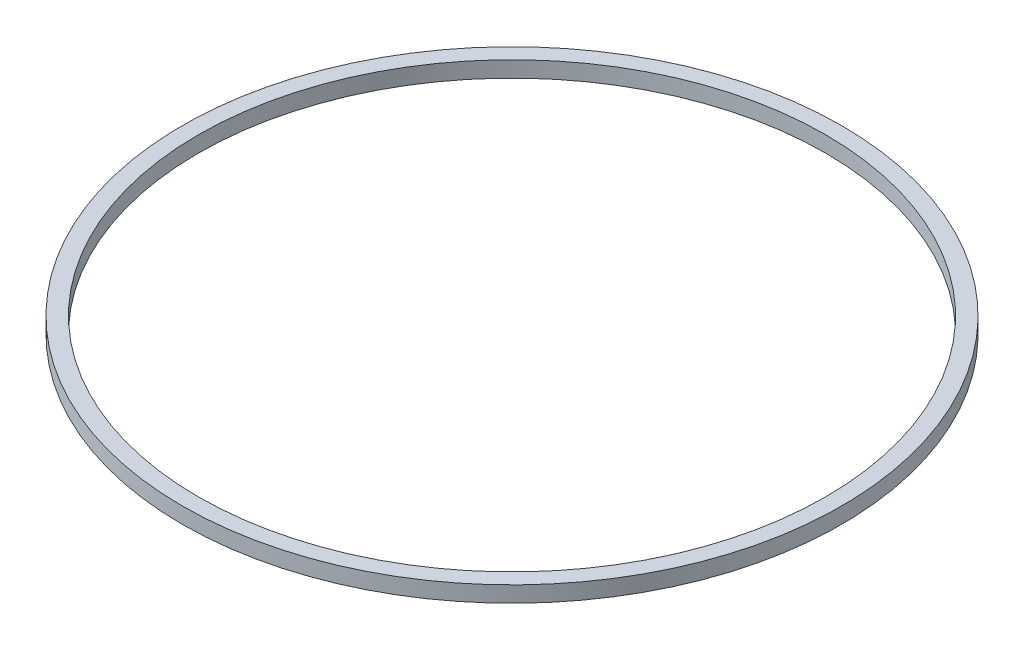
ISO-10303-21;
HEADER;
FILE_DESCRIPTION(('STEP AP214'),'2;1');
FILE_NAME('part.step','',(''),(''),'','','');
FILE_SCHEMA(('AUTOMOTIVE_DESIGN { 1 0 10303 214 1 1 1 1 }'));
ENDSEC;
DATA;
#1=APPLICATION_CONTEXT('core data for automotive mechanical design processes');
#2=APPLICATION_PROTOCOL_DEFINITION('international standard','automotive_design',2000,#1);
#3=PRODUCT_CONTEXT('',#1,'mechanical');
#4=PRODUCT('Part','Part','',(#3));
#5=PRODUCT_RELATED_PRODUCT_CATEGORY('part','',(#4));
#6=PRODUCT_DEFINITION_FORMATION('','',#4);
#7=PRODUCT_DEFINITION_CONTEXT('part definition',#1,'design');
#8=PRODUCT_DEFINITION('design','',#6,#7);
#9=PRODUCT_DEFINITION_SHAPE('','',#8);
#10=(LENGTH_UNIT() NAMED_UNIT(*) SI_UNIT(.MILLI.,.METRE.));
#11=(NAMED_UNIT(*) PLANE_ANGLE_UNIT() SI_UNIT($,.RADIAN.));
#12=(NAMED_UNIT(*) SI_UNIT($,.STERADIAN.) SOLID_ANGLE_UNIT());
#13=UNCERTAINTY_MEASURE_WITH_UNIT(LENGTH_MEASURE(1.E-05),#10,'distance_accuracy_value','');
#14=(GEOMETRIC_REPRESENTATION_CONTEXT(3) GLOBAL_UNCERTAINTY_ASSIGNED_CONTEXT((#13)) GLOBAL_UNIT_ASSIGNED_CONTEXT((#10,
#11,#12)) REPRESENTATION_CONTEXT('',''));
#15=CARTESIAN_POINT('',(0.,0.,0.));
#16=DIRECTION('',(0.,0.,1.));
#17=DIRECTION('',(1.,0.,0.));
#18=AXIS2_PLACEMENT_3D('',#15,#16,#17);
#19=CARTESIAN_POINT('',(0.,0.,0.));
#20=DIRECTION('',(0.,-1.,0.));
#21=DIRECTION('',(0.,0.,-1.));
#22=AXIS2_PLACEMENT_3D('',#19,#20,#21);
#23=CYLINDRICAL_SURFACE('',#22,1576.2);
#24=CARTESIAN_POINT('',(0.,25.135416666667,0.));
#25=DIRECTION('',(0.,-1.,0.));
#26=DIRECTION('',(0.,0.,-1.));
#27=AXIS2_PLACEMENT_3D('',#24,#25,#26);
#28=CIRCLE('',#27,1576.2);
#29=CARTESIAN_POINT('',(0.,25.135416666667,-1576.2));
#30=VERTEX_POINT('',#29);
#31=EDGE_CURVE('E10',#30,#30,#28,.T.);
#32=ORIENTED_EDGE('',*,*,#31,.T.);
#33=EDGE_LOOP('',(#32));
#34=FACE_BOUND('',#33,.T.);
#35=CARTESIAN_POINT('',(0.,-51.064583333333,0.));
#36=DIRECTION('',(0.,-1.,0.));
#37=DIRECTION('',(0.,0.,-1.));
#38=AXIS2_PLACEMENT_3D('',#35,#36,#37);
#39=CIRCLE('',#38,1576.2);
#40=CARTESIAN_POINT('',(0.,-51.064583333333,-1576.2));
#41=VERTEX_POINT('',#40);
#42=EDGE_CURVE('E49',#41,#41,#39,.T.);
#43=ORIENTED_EDGE('',*,*,#42,.F.);
#44=EDGE_LOOP('',(#43));
#45=FACE_BOUND('',#44,.T.);
#46=ADVANCED_FACE('F35',(#34,#45),#23,.T.);
#47=CARTESIAN_POINT('',(1500.,25.135416666667,0.));
#48=DIRECTION('',(0.,1.,0.));
#49=DIRECTION('',(0.,0.,1.));
#50=AXIS2_PLACEMENT_3D('',#47,#48,#49);
#51=PLANE('',#50);
#52=CARTESIAN_POINT('',(0.,25.135416666667,0.));
#53=DIRECTION('',(0.,-1.,0.));
#54=DIRECTION('',(0.,0.,-1.));
#55=AXIS2_PLACEMENT_3D('',#52,#53,#54);
#56=CIRCLE('',#55,1500.);
#57=CARTESIAN_POINT('',(0.,25.135416666667,-1500.));
#58=VERTEX_POINT('',#57);
#59=EDGE_CURVE('E41',#58,#58,#56,.T.);
#60=ORIENTED_EDGE('',*,*,#59,.T.);
#61=EDGE_LOOP('',(#60));
#62=FACE_BOUND('',#61,.T.);
#63=ORIENTED_EDGE('',*,*,#31,.F.);
#64=EDGE_LOOP('',(#63));
#65=FACE_BOUND('',#64,.T.);
#66=ADVANCED_FACE('F59',(#62,#65),#51,.T.);
#67=CARTESIAN_POINT('',(0.,0.,0.));
#68=DIRECTION('',(0.,-1.,0.));
#69=DIRECTION('',(0.,0.,-1.));
#70=AXIS2_PLACEMENT_3D('',#67,#68,#69);
#71=CYLINDRICAL_SURFACE('',#70,1500.);
#72=CARTESIAN_POINT('',(0.,-51.064583333333,0.));
#73=DIRECTION('',(0.,-1.,0.));
#74=DIRECTION('',(0.,0.,-1.));
#75=AXIS2_PLACEMENT_3D('',#72,#73,#74);
#76=CIRCLE('',#75,1500.);
#77=CARTESIAN_POINT('',(0.,-51.064583333333,-1500.));
#78=VERTEX_POINT('',#77);
#79=EDGE_CURVE('E45',#78,#78,#76,.T.);
#80=ORIENTED_EDGE('',*,*,#79,.T.);
#81=EDGE_LOOP('',(#80));
#82=FACE_BOUND('',#81,.T.);
#83=ORIENTED_EDGE('',*,*,#59,.F.);
#84=EDGE_LOOP('',(#83));
#85=FACE_BOUND('',#84,.T.);
#86=ADVANCED_FACE('F63',(#82,#85),#71,.F.);
#87=CARTESIAN_POINT('',(1500.,-51.064583333333,0.));
#88=DIRECTION('',(0.,-1.,0.));
#89=DIRECTION('',(0.,0.,-1.));
#90=AXIS2_PLACEMENT_3D('',#87,#88,#89);
#91=PLANE('',#90);
#92=ORIENTED_EDGE('',*,*,#42,.T.);
#93=EDGE_LOOP('',(#92));
#94=FACE_BOUND('',#93,.T.);
#95=ORIENTED_EDGE('',*,*,#79,.F.);
#96=EDGE_LOOP('',(#95));
#97=FACE_BOUND('',#96,.T.);
#98=ADVANCED_FACE('F55',(#94,#97),#91,.T.);
#99=CLOSED_SHELL('',(#46,#66,#86,#98));
#100=MANIFOLD_SOLID_BREP('B2',#99);
#101=ADVANCED_BREP_SHAPE_REPRESENTATION('',(#18,#100),#14);
#102=SHAPE_DEFINITION_REPRESENTATION(#9,#101);
ENDSEC;
END-ISO-10303-21;
